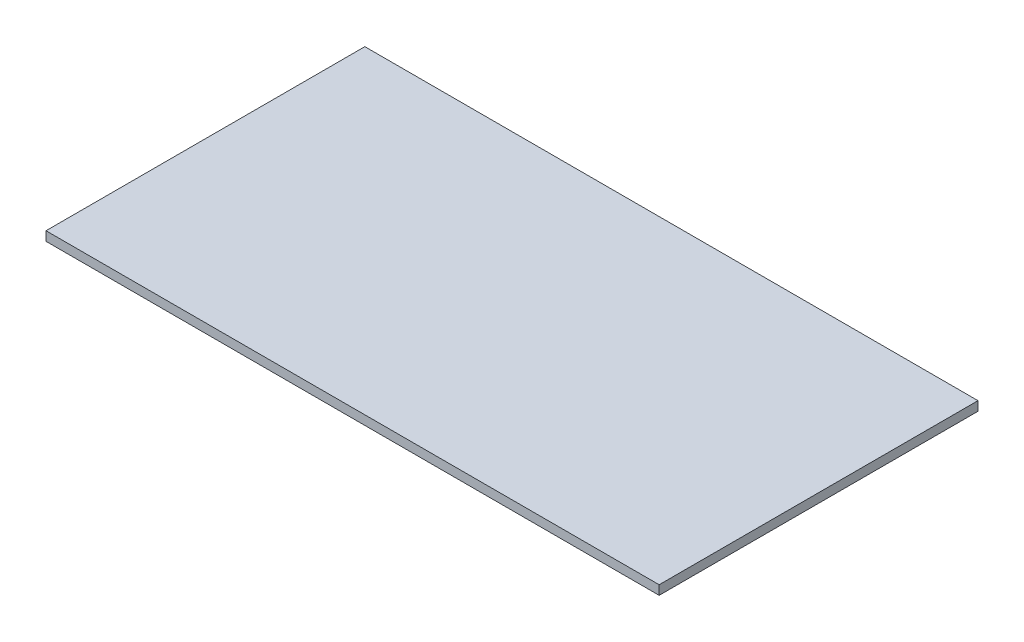
ISO-10303-21;
HEADER;
FILE_DESCRIPTION(('STEP AP214'),'2;1');
FILE_NAME('part.step','',(''),(''),'','','');
FILE_SCHEMA(('AUTOMOTIVE_DESIGN { 1 0 10303 214 1 1 1 1 }'));
ENDSEC;
DATA;
#1=APPLICATION_CONTEXT('core data for automotive mechanical design processes');
#2=APPLICATION_PROTOCOL_DEFINITION('international standard','automotive_design',2000,#1);
#3=PRODUCT_CONTEXT('',#1,'mechanical');
#4=PRODUCT('Part','Part','',(#3));
#5=PRODUCT_RELATED_PRODUCT_CATEGORY('part','',(#4));
#6=PRODUCT_DEFINITION_FORMATION('','',#4);
#7=PRODUCT_DEFINITION_CONTEXT('part definition',#1,'design');
#8=PRODUCT_DEFINITION('design','',#6,#7);
#9=PRODUCT_DEFINITION_SHAPE('','',#8);
#10=(LENGTH_UNIT() NAMED_UNIT(*) SI_UNIT(.MILLI.,.METRE.));
#11=(NAMED_UNIT(*) PLANE_ANGLE_UNIT() SI_UNIT($,.RADIAN.));
#12=(NAMED_UNIT(*) SI_UNIT($,.STERADIAN.) SOLID_ANGLE_UNIT());
#13=UNCERTAINTY_MEASURE_WITH_UNIT(LENGTH_MEASURE(1.E-05),#10,'distance_accuracy_value','');
#14=(GEOMETRIC_REPRESENTATION_CONTEXT(3) GLOBAL_UNCERTAINTY_ASSIGNED_CONTEXT((#13)) GLOBAL_UNIT_ASSIGNED_CONTEXT((#10,
#11,#12)) REPRESENTATION_CONTEXT('',''));
#15=CARTESIAN_POINT('',(0.,0.,0.));
#16=DIRECTION('',(0.,0.,1.));
#17=DIRECTION('',(1.,0.,0.));
#18=AXIS2_PLACEMENT_3D('',#15,#16,#17);
#19=CARTESIAN_POINT('',(635.,19.05,330.2));
#20=DIRECTION('',(-1.,0.,0.));
#21=DIRECTION('',(0.,0.,1.));
#22=AXIS2_PLACEMENT_3D('',#19,#20,#21);
#23=PLANE('',#22);
#24=DIRECTION('',(0.,0.,-1.));
#25=VECTOR('',#24,1.);
#26=CARTESIAN_POINT('',(635.,0.,330.2));
#27=LINE('',#26,#25);
#28=CARTESIAN_POINT('',(635.,0.,330.2));
#29=VERTEX_POINT('',#28);
#30=CARTESIAN_POINT('',(635.,0.,-330.2));
#31=VERTEX_POINT('',#30);
#32=EDGE_CURVE('E96',#29,#31,#27,.T.);
#33=ORIENTED_EDGE('',*,*,#32,.T.);
#34=DIRECTION('',(0.,-1.,0.));
#35=VECTOR('',#34,1.);
#36=CARTESIAN_POINT('',(635.,19.05,-330.2));
#37=LINE('',#36,#35);
#38=CARTESIAN_POINT('',(635.,19.05,-330.2));
#39=VERTEX_POINT('',#38);
#40=EDGE_CURVE('E11',#39,#31,#37,.T.);
#41=ORIENTED_EDGE('',*,*,#40,.F.);
#42=DIRECTION('',(0.,0.,-1.));
#43=VECTOR('',#42,1.);
#44=CARTESIAN_POINT('',(635.,19.05,330.2));
#45=LINE('',#44,#43);
#46=CARTESIAN_POINT('',(635.,19.05,330.2));
#47=VERTEX_POINT('',#46);
#48=EDGE_CURVE('E84',#47,#39,#45,.T.);
#49=ORIENTED_EDGE('',*,*,#48,.F.);
#50=DIRECTION('',(0.,-1.,0.));
#51=VECTOR('',#50,1.);
#52=CARTESIAN_POINT('',(635.,19.05,330.2));
#53=LINE('',#52,#51);
#54=EDGE_CURVE('E92',#47,#29,#53,.T.);
#55=ORIENTED_EDGE('',*,*,#54,.T.);
#56=EDGE_LOOP('',(#33,#41,#49,#55));
#57=FACE_BOUND('',#56,.T.);
#58=ADVANCED_FACE('F33',(#57),#23,.F.);
#59=CARTESIAN_POINT('',(-635.,19.05,-330.2));
#60=DIRECTION('',(0.,0.,1.));
#61=DIRECTION('',(1.,0.,0.));
#62=AXIS2_PLACEMENT_3D('',#59,#60,#61);
#63=PLANE('',#62);
#64=DIRECTION('',(-1.,0.,0.));
#65=VECTOR('',#64,1.);
#66=CARTESIAN_POINT('',(-635.,0.,-330.2));
#67=LINE('',#66,#65);
#68=CARTESIAN_POINT('',(-635.,0.,-330.2));
#69=VERTEX_POINT('',#68);
#70=EDGE_CURVE('E88',#31,#69,#67,.T.);
#71=ORIENTED_EDGE('',*,*,#70,.T.);
#72=DIRECTION('',(0.,-1.,0.));
#73=VECTOR('',#72,1.);
#74=CARTESIAN_POINT('',(-635.,19.05,-330.2));
#75=LINE('',#74,#73);
#76=CARTESIAN_POINT('',(-635.,19.05,-330.2));
#77=VERTEX_POINT('',#76);
#78=EDGE_CURVE('E41',#77,#69,#75,.T.);
#79=ORIENTED_EDGE('',*,*,#78,.F.);
#80=DIRECTION('',(-1.,0.,0.));
#81=VECTOR('',#80,1.);
#82=CARTESIAN_POINT('',(-635.,19.05,-330.2));
#83=LINE('',#82,#81);
#84=EDGE_CURVE('E79',#39,#77,#83,.T.);
#85=ORIENTED_EDGE('',*,*,#84,.F.);
#86=ORIENTED_EDGE('',*,*,#40,.T.);
#87=EDGE_LOOP('',(#71,#79,#85,#86));
#88=FACE_BOUND('',#87,.T.);
#89=ADVANCED_FACE('F87',(#88),#63,.F.);
#90=CARTESIAN_POINT('',(-635.,19.05,330.2));
#91=DIRECTION('',(1.,0.,0.));
#92=DIRECTION('',(0.,0.,-1.));
#93=AXIS2_PLACEMENT_3D('',#90,#91,#92);
#94=PLANE('',#93);
#95=DIRECTION('',(0.,0.,1.));
#96=VECTOR('',#95,1.);
#97=CARTESIAN_POINT('',(-635.,0.,330.2));
#98=LINE('',#97,#96);
#99=CARTESIAN_POINT('',(-635.,0.,330.2));
#100=VERTEX_POINT('',#99);
#101=EDGE_CURVE('E66',#69,#100,#98,.T.);
#102=ORIENTED_EDGE('',*,*,#101,.T.);
#103=DIRECTION('',(0.,-1.,0.));
#104=VECTOR('',#103,1.);
#105=CARTESIAN_POINT('',(-635.,19.05,330.2));
#106=LINE('',#105,#104);
#107=CARTESIAN_POINT('',(-635.,19.05,330.2));
#108=VERTEX_POINT('',#107);
#109=EDGE_CURVE('E89',#108,#100,#106,.T.);
#110=ORIENTED_EDGE('',*,*,#109,.F.);
#111=DIRECTION('',(0.,0.,1.));
#112=VECTOR('',#111,1.);
#113=CARTESIAN_POINT('',(-635.,19.05,330.2));
#114=LINE('',#113,#112);
#115=EDGE_CURVE('E82',#77,#108,#114,.T.);
#116=ORIENTED_EDGE('',*,*,#115,.F.);
#117=ORIENTED_EDGE('',*,*,#78,.T.);
#118=EDGE_LOOP('',(#102,#110,#116,#117));
#119=FACE_BOUND('',#118,.T.);
#120=ADVANCED_FACE('F90',(#119),#94,.F.);
#121=CARTESIAN_POINT('',(-635.,19.05,330.2));
#122=DIRECTION('',(0.,0.,-1.));
#123=DIRECTION('',(-1.,0.,0.));
#124=AXIS2_PLACEMENT_3D('',#121,#122,#123);
#125=PLANE('',#124);
#126=DIRECTION('',(1.,0.,0.));
#127=VECTOR('',#126,1.);
#128=CARTESIAN_POINT('',(-635.,0.,330.2));
#129=LINE('',#128,#127);
#130=EDGE_CURVE('E72',#100,#29,#129,.T.);
#131=ORIENTED_EDGE('',*,*,#130,.T.);
#132=ORIENTED_EDGE('',*,*,#54,.F.);
#133=DIRECTION('',(1.,0.,0.));
#134=VECTOR('',#133,1.);
#135=CARTESIAN_POINT('',(-635.,19.05,330.2));
#136=LINE('',#135,#134);
#137=EDGE_CURVE('E49',#108,#47,#136,.T.);
#138=ORIENTED_EDGE('',*,*,#137,.F.);
#139=ORIENTED_EDGE('',*,*,#109,.T.);
#140=EDGE_LOOP('',(#131,#132,#138,#139));
#141=FACE_BOUND('',#140,.T.);
#142=ADVANCED_FACE('F103',(#141),#125,.F.);
#143=CARTESIAN_POINT('',(0.,19.05,0.));
#144=DIRECTION('',(0.,-1.,0.));
#145=DIRECTION('',(0.,0.,-1.));
#146=AXIS2_PLACEMENT_3D('',#143,#144,#145);
#147=PLANE('',#146);
#148=ORIENTED_EDGE('',*,*,#48,.T.);
#149=ORIENTED_EDGE('',*,*,#84,.T.);
#150=ORIENTED_EDGE('',*,*,#115,.T.);
#151=ORIENTED_EDGE('',*,*,#137,.T.);
#152=EDGE_LOOP('',(#148,#149,#150,#151));
#153=FACE_BOUND('',#152,.T.);
#154=ADVANCED_FACE('F80',(#153),#147,.F.);
#155=CARTESIAN_POINT('',(0.,0.,0.));
#156=DIRECTION('',(0.,-1.,0.));
#157=DIRECTION('',(0.,0.,-1.));
#158=AXIS2_PLACEMENT_3D('',#155,#156,#157);
#159=PLANE('',#158);
#160=ORIENTED_EDGE('',*,*,#32,.F.);
#161=ORIENTED_EDGE('',*,*,#130,.F.);
#162=ORIENTED_EDGE('',*,*,#101,.F.);
#163=ORIENTED_EDGE('',*,*,#70,.F.);
#164=EDGE_LOOP('',(#160,#161,#162,#163));
#165=FACE_BOUND('',#164,.T.);
#166=ADVANCED_FACE('F106',(#165),#159,.T.);
#167=CLOSED_SHELL('',(#58,#89,#120,#142,#154,#166));
#168=MANIFOLD_SOLID_BREP('B2',#167);
#169=ADVANCED_BREP_SHAPE_REPRESENTATION('',(#18,#168),#14);
#170=SHAPE_DEFINITION_REPRESENTATION(#9,#169);
ENDSEC;
END-ISO-10303-21;
